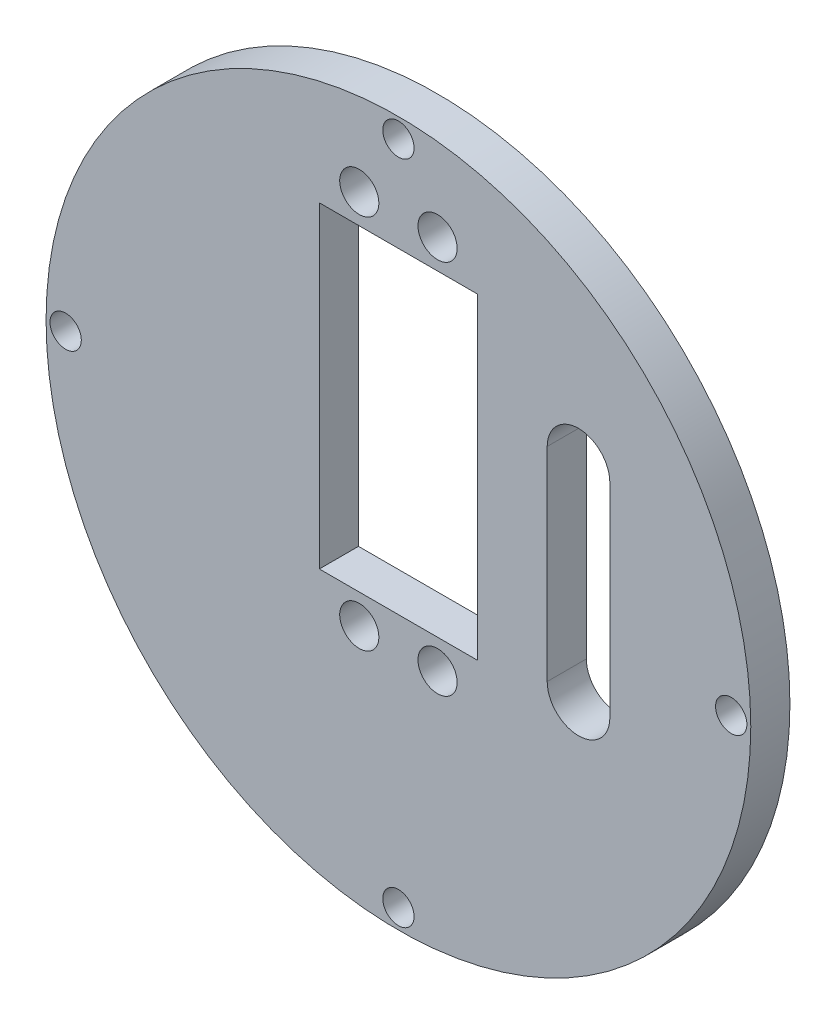
ISO-10303-21;
HEADER;
FILE_DESCRIPTION(('STEP AP214'),'2;1');
FILE_NAME('part.step','',(''),(''),'','','');
FILE_SCHEMA(('AUTOMOTIVE_DESIGN { 1 0 10303 214 1 1 1 1 }'));
ENDSEC;
DATA;
#1=APPLICATION_CONTEXT('core data for automotive mechanical design processes');
#2=APPLICATION_PROTOCOL_DEFINITION('international standard','automotive_design',2000,#1);
#3=PRODUCT_CONTEXT('',#1,'mechanical');
#4=PRODUCT('Part','Part','',(#3));
#5=PRODUCT_RELATED_PRODUCT_CATEGORY('part','',(#4));
#6=PRODUCT_DEFINITION_FORMATION('','',#4);
#7=PRODUCT_DEFINITION_CONTEXT('part definition',#1,'design');
#8=PRODUCT_DEFINITION('design','',#6,#7);
#9=PRODUCT_DEFINITION_SHAPE('','',#8);
#10=(LENGTH_UNIT() NAMED_UNIT(*) SI_UNIT(.MILLI.,.METRE.));
#11=(NAMED_UNIT(*) PLANE_ANGLE_UNIT() SI_UNIT($,.RADIAN.));
#12=(NAMED_UNIT(*) SI_UNIT($,.STERADIAN.) SOLID_ANGLE_UNIT());
#13=UNCERTAINTY_MEASURE_WITH_UNIT(LENGTH_MEASURE(1.E-05),#10,'distance_accuracy_value','');
#14=(GEOMETRIC_REPRESENTATION_CONTEXT(3) GLOBAL_UNCERTAINTY_ASSIGNED_CONTEXT((#13)) GLOBAL_UNIT_ASSIGNED_CONTEXT((#10,
#11,#12)) REPRESENTATION_CONTEXT('',''));
#15=CARTESIAN_POINT('',(0.,0.,0.));
#16=DIRECTION('',(0.,0.,1.));
#17=DIRECTION('',(1.,0.,0.));
#18=AXIS2_PLACEMENT_3D('',#15,#16,#17);
#19=CARTESIAN_POINT('',(0.,30.4,5.));
#20=DIRECTION('',(0.,1.,0.));
#21=DIRECTION('',(0.,0.,1.));
#22=AXIS2_PLACEMENT_3D('',#19,#20,#21);
#23=PLANE('',#22);
#24=DIRECTION('',(1.,0.,0.));
#25=VECTOR('',#24,1.);
#26=CARTESIAN_POINT('',(0.,30.4,0.));
#27=LINE('',#26,#25);
#28=CARTESIAN_POINT('',(-10.1,30.4,0.));
#29=VERTEX_POINT('',#28);
#30=CARTESIAN_POINT('',(10.1,30.4,0.));
#31=VERTEX_POINT('',#30);
#32=EDGE_CURVE('E203',#29,#31,#27,.T.);
#33=ORIENTED_EDGE('',*,*,#32,.T.);
#34=DIRECTION('',(0.,0.,-1.));
#35=VECTOR('',#34,1.);
#36=CARTESIAN_POINT('',(10.1,30.4,5.));
#37=LINE('',#36,#35);
#38=CARTESIAN_POINT('',(10.1,30.4,5.));
#39=VERTEX_POINT('',#38);
#40=EDGE_CURVE('E222',#39,#31,#37,.T.);
#41=ORIENTED_EDGE('',*,*,#40,.F.);
#42=DIRECTION('',(1.,0.,0.));
#43=VECTOR('',#42,1.);
#44=CARTESIAN_POINT('',(0.,30.4,5.));
#45=LINE('',#44,#43);
#46=CARTESIAN_POINT('',(-10.1,30.4,5.));
#47=VERTEX_POINT('',#46);
#48=EDGE_CURVE('E165',#47,#39,#45,.T.);
#49=ORIENTED_EDGE('',*,*,#48,.F.);
#50=DIRECTION('',(0.,0.,-1.));
#51=VECTOR('',#50,1.);
#52=CARTESIAN_POINT('',(-10.1,30.4,5.));
#53=LINE('',#52,#51);
#54=EDGE_CURVE('E179',#47,#29,#53,.T.);
#55=ORIENTED_EDGE('',*,*,#54,.T.);
#56=EDGE_LOOP('',(#33,#41,#49,#55));
#57=FACE_BOUND('',#56,.T.);
#58=ADVANCED_FACE('F46',(#57),#23,.F.);
#59=CARTESIAN_POINT('',(10.1,0.,5.));
#60=DIRECTION('',(1.,0.,0.));
#61=DIRECTION('',(0.,1.,0.));
#62=AXIS2_PLACEMENT_3D('',#59,#60,#61);
#63=PLANE('',#62);
#64=DIRECTION('',(0.,-1.,0.));
#65=VECTOR('',#64,1.);
#66=CARTESIAN_POINT('',(10.1,0.,0.));
#67=LINE('',#66,#65);
#68=CARTESIAN_POINT('',(10.1,-10.1,0.));
#69=VERTEX_POINT('',#68);
#70=EDGE_CURVE('E206',#31,#69,#67,.T.);
#71=ORIENTED_EDGE('',*,*,#70,.T.);
#72=DIRECTION('',(0.,0.,-1.));
#73=VECTOR('',#72,1.);
#74=CARTESIAN_POINT('',(10.1,-10.1,5.));
#75=LINE('',#74,#73);
#76=CARTESIAN_POINT('',(10.1,-10.1,5.));
#77=VERTEX_POINT('',#76);
#78=EDGE_CURVE('E220',#77,#69,#75,.T.);
#79=ORIENTED_EDGE('',*,*,#78,.F.);
#80=DIRECTION('',(0.,-1.,0.));
#81=VECTOR('',#80,1.);
#82=CARTESIAN_POINT('',(10.1,0.,5.));
#83=LINE('',#82,#81);
#84=EDGE_CURVE('E168',#39,#77,#83,.T.);
#85=ORIENTED_EDGE('',*,*,#84,.F.);
#86=ORIENTED_EDGE('',*,*,#40,.T.);
#87=EDGE_LOOP('',(#71,#79,#85,#86));
#88=FACE_BOUND('',#87,.T.);
#89=ADVANCED_FACE('F247',(#88),#63,.F.);
#90=CARTESIAN_POINT('',(0.,-10.1,5.));
#91=DIRECTION('',(0.,1.,0.));
#92=DIRECTION('',(0.,0.,1.));
#93=AXIS2_PLACEMENT_3D('',#90,#91,#92);
#94=PLANE('',#93);
#95=DIRECTION('',(1.,0.,0.));
#96=VECTOR('',#95,1.);
#97=CARTESIAN_POINT('',(0.,-10.1,0.));
#98=LINE('',#97,#96);
#99=CARTESIAN_POINT('',(-10.1,-10.1,0.));
#100=VERTEX_POINT('',#99);
#101=EDGE_CURVE('E209',#100,#69,#98,.T.);
#102=ORIENTED_EDGE('',*,*,#101,.F.);
#103=DIRECTION('',(0.,0.,-1.));
#104=VECTOR('',#103,1.);
#105=CARTESIAN_POINT('',(-10.1,-10.1,5.));
#106=LINE('',#105,#104);
#107=CARTESIAN_POINT('',(-10.1,-10.1,5.));
#108=VERTEX_POINT('',#107);
#109=EDGE_CURVE('E218',#108,#100,#106,.T.);
#110=ORIENTED_EDGE('',*,*,#109,.F.);
#111=DIRECTION('',(1.,0.,0.));
#112=VECTOR('',#111,1.);
#113=CARTESIAN_POINT('',(0.,-10.1,5.));
#114=LINE('',#113,#112);
#115=EDGE_CURVE('E170',#108,#77,#114,.T.);
#116=ORIENTED_EDGE('',*,*,#115,.T.);
#117=ORIENTED_EDGE('',*,*,#78,.T.);
#118=EDGE_LOOP('',(#102,#110,#116,#117));
#119=FACE_BOUND('',#118,.T.);
#120=ADVANCED_FACE('F253',(#119),#94,.T.);
#121=CARTESIAN_POINT('',(-10.1,0.,5.));
#122=DIRECTION('',(1.,0.,0.));
#123=DIRECTION('',(0.,1.,0.));
#124=AXIS2_PLACEMENT_3D('',#121,#122,#123);
#125=PLANE('',#124);
#126=DIRECTION('',(0.,-1.,0.));
#127=VECTOR('',#126,1.);
#128=CARTESIAN_POINT('',(-10.1,0.,0.));
#129=LINE('',#128,#127);
#130=EDGE_CURVE('E212',#29,#100,#129,.T.);
#131=ORIENTED_EDGE('',*,*,#130,.F.);
#132=ORIENTED_EDGE('',*,*,#54,.F.);
#133=DIRECTION('',(0.,-1.,0.));
#134=VECTOR('',#133,1.);
#135=CARTESIAN_POINT('',(-10.1,0.,5.));
#136=LINE('',#135,#134);
#137=EDGE_CURVE('E173',#47,#108,#136,.T.);
#138=ORIENTED_EDGE('',*,*,#137,.T.);
#139=ORIENTED_EDGE('',*,*,#109,.T.);
#140=EDGE_LOOP('',(#131,#132,#138,#139));
#141=FACE_BOUND('',#140,.T.);
#142=ADVANCED_FACE('F262',(#141),#125,.T.);
#143=CARTESIAN_POINT('',(-5.,34.15,5.));
#144=DIRECTION('',(0.,0.,-1.));
#145=DIRECTION('',(-1.,0.,0.));
#146=AXIS2_PLACEMENT_3D('',#143,#144,#145);
#147=CYLINDRICAL_SURFACE('',#146,2.5);
#148=CARTESIAN_POINT('',(-5.,34.15,5.));
#149=DIRECTION('',(0.,0.,1.));
#150=DIRECTION('',(1.,0.,0.));
#151=AXIS2_PLACEMENT_3D('',#148,#149,#150);
#152=CIRCLE('',#151,2.5);
#153=CARTESIAN_POINT('',(-2.5,34.15,5.));
#154=VERTEX_POINT('',#153);
#155=EDGE_CURVE('E162',#154,#154,#152,.T.);
#156=ORIENTED_EDGE('',*,*,#155,.T.);
#157=EDGE_LOOP('',(#156));
#158=FACE_BOUND('',#157,.T.);
#159=CARTESIAN_POINT('',(-5.,34.15,0.));
#160=DIRECTION('',(0.,0.,1.));
#161=DIRECTION('',(1.,0.,0.));
#162=AXIS2_PLACEMENT_3D('',#159,#160,#161);
#163=CIRCLE('',#162,2.5);
#164=CARTESIAN_POINT('',(-2.5,34.15,0.));
#165=VERTEX_POINT('',#164);
#166=EDGE_CURVE('E200',#165,#165,#163,.T.);
#167=ORIENTED_EDGE('',*,*,#166,.F.);
#168=EDGE_LOOP('',(#167));
#169=FACE_BOUND('',#168,.T.);
#170=ADVANCED_FACE('F258',(#158,#169),#147,.F.);
#171=CARTESIAN_POINT('',(5.,34.15,5.));
#172=DIRECTION('',(0.,0.,-1.));
#173=DIRECTION('',(-1.,0.,0.));
#174=AXIS2_PLACEMENT_3D('',#171,#172,#173);
#175=CYLINDRICAL_SURFACE('',#174,2.5);
#176=CARTESIAN_POINT('',(5.,34.15,5.));
#177=DIRECTION('',(0.,0.,1.));
#178=DIRECTION('',(1.,0.,0.));
#179=AXIS2_PLACEMENT_3D('',#176,#177,#178);
#180=CIRCLE('',#179,2.5);
#181=CARTESIAN_POINT('',(7.5,34.15,5.));
#182=VERTEX_POINT('',#181);
#183=EDGE_CURVE('E159',#182,#182,#180,.T.);
#184=ORIENTED_EDGE('',*,*,#183,.T.);
#185=EDGE_LOOP('',(#184));
#186=FACE_BOUND('',#185,.T.);
#187=CARTESIAN_POINT('',(5.,34.15,0.));
#188=DIRECTION('',(0.,0.,1.));
#189=DIRECTION('',(1.,0.,0.));
#190=AXIS2_PLACEMENT_3D('',#187,#188,#189);
#191=CIRCLE('',#190,2.5);
#192=CARTESIAN_POINT('',(7.5,34.15,0.));
#193=VERTEX_POINT('',#192);
#194=EDGE_CURVE('E197',#193,#193,#191,.T.);
#195=ORIENTED_EDGE('',*,*,#194,.F.);
#196=EDGE_LOOP('',(#195));
#197=FACE_BOUND('',#196,.T.);
#198=ADVANCED_FACE('F261',(#186,#197),#175,.F.);
#199=CARTESIAN_POINT('',(5.00000000000001,-13.85,5.));
#200=DIRECTION('',(0.,0.,-1.));
#201=DIRECTION('',(-1.,0.,0.));
#202=AXIS2_PLACEMENT_3D('',#199,#200,#201);
#203=CYLINDRICAL_SURFACE('',#202,2.5);
#204=CARTESIAN_POINT('',(5.00000000000001,-13.85,5.));
#205=DIRECTION('',(0.,0.,1.));
#206=DIRECTION('',(1.,0.,0.));
#207=AXIS2_PLACEMENT_3D('',#204,#205,#206);
#208=CIRCLE('',#207,2.5);
#209=CARTESIAN_POINT('',(7.50000000000001,-13.85,5.));
#210=VERTEX_POINT('',#209);
#211=EDGE_CURVE('E156',#210,#210,#208,.T.);
#212=ORIENTED_EDGE('',*,*,#211,.T.);
#213=EDGE_LOOP('',(#212));
#214=FACE_BOUND('',#213,.T.);
#215=CARTESIAN_POINT('',(5.00000000000001,-13.85,0.));
#216=DIRECTION('',(0.,0.,1.));
#217=DIRECTION('',(1.,0.,0.));
#218=AXIS2_PLACEMENT_3D('',#215,#216,#217);
#219=CIRCLE('',#218,2.5);
#220=CARTESIAN_POINT('',(7.50000000000001,-13.85,0.));
#221=VERTEX_POINT('',#220);
#222=EDGE_CURVE('E194',#221,#221,#219,.T.);
#223=ORIENTED_EDGE('',*,*,#222,.F.);
#224=EDGE_LOOP('',(#223));
#225=FACE_BOUND('',#224,.T.);
#226=ADVANCED_FACE('F266',(#214,#225),#203,.F.);
#227=CARTESIAN_POINT('',(-4.99999999999999,-13.85,5.));
#228=DIRECTION('',(0.,0.,-1.));
#229=DIRECTION('',(-1.,0.,0.));
#230=AXIS2_PLACEMENT_3D('',#227,#228,#229);
#231=CYLINDRICAL_SURFACE('',#230,2.5);
#232=CARTESIAN_POINT('',(-4.99999999999999,-13.85,5.));
#233=DIRECTION('',(0.,0.,1.));
#234=DIRECTION('',(1.,0.,0.));
#235=AXIS2_PLACEMENT_3D('',#232,#233,#234);
#236=CIRCLE('',#235,2.5);
#237=CARTESIAN_POINT('',(-2.49999999999999,-13.85,5.));
#238=VERTEX_POINT('',#237);
#239=EDGE_CURVE('E153',#238,#238,#236,.T.);
#240=ORIENTED_EDGE('',*,*,#239,.T.);
#241=EDGE_LOOP('',(#240));
#242=FACE_BOUND('',#241,.T.);
#243=CARTESIAN_POINT('',(-4.99999999999999,-13.85,0.));
#244=DIRECTION('',(0.,0.,1.));
#245=DIRECTION('',(1.,0.,0.));
#246=AXIS2_PLACEMENT_3D('',#243,#244,#245);
#247=CIRCLE('',#246,2.5);
#248=CARTESIAN_POINT('',(-2.49999999999999,-13.85,0.));
#249=VERTEX_POINT('',#248);
#250=EDGE_CURVE('E191',#249,#249,#247,.T.);
#251=ORIENTED_EDGE('',*,*,#250,.F.);
#252=EDGE_LOOP('',(#251));
#253=FACE_BOUND('',#252,.T.);
#254=ADVANCED_FACE('F270',(#242,#253),#231,.F.);
#255=CARTESIAN_POINT('',(42.5,0.,5.));
#256=DIRECTION('',(0.,0.,-1.));
#257=DIRECTION('',(-1.,0.,0.));
#258=AXIS2_PLACEMENT_3D('',#255,#256,#257);
#259=CYLINDRICAL_SURFACE('',#258,2.);
#260=CARTESIAN_POINT('',(42.5,0.,5.));
#261=DIRECTION('',(0.,0.,1.));
#262=DIRECTION('',(1.,0.,0.));
#263=AXIS2_PLACEMENT_3D('',#260,#261,#262);
#264=CIRCLE('',#263,2.);
#265=CARTESIAN_POINT('',(44.5,0.,5.));
#266=VERTEX_POINT('',#265);
#267=EDGE_CURVE('E150',#266,#266,#264,.T.);
#268=ORIENTED_EDGE('',*,*,#267,.T.);
#269=EDGE_LOOP('',(#268));
#270=FACE_BOUND('',#269,.T.);
#271=CARTESIAN_POINT('',(42.5,0.,0.));
#272=DIRECTION('',(0.,0.,1.));
#273=DIRECTION('',(1.,0.,0.));
#274=AXIS2_PLACEMENT_3D('',#271,#272,#273);
#275=CIRCLE('',#274,2.);
#276=CARTESIAN_POINT('',(44.5,0.,0.));
#277=VERTEX_POINT('',#276);
#278=EDGE_CURVE('E188',#277,#277,#275,.T.);
#279=ORIENTED_EDGE('',*,*,#278,.F.);
#280=EDGE_LOOP('',(#279));
#281=FACE_BOUND('',#280,.T.);
#282=ADVANCED_FACE('F274',(#270,#281),#259,.F.);
#283=CARTESIAN_POINT('',(0.,-42.5,5.));
#284=DIRECTION('',(0.,0.,-1.));
#285=DIRECTION('',(-1.,0.,0.));
#286=AXIS2_PLACEMENT_3D('',#283,#284,#285);
#287=CYLINDRICAL_SURFACE('',#286,2.);
#288=CARTESIAN_POINT('',(0.,-42.5,5.));
#289=DIRECTION('',(0.,0.,1.));
#290=DIRECTION('',(1.,0.,0.));
#291=AXIS2_PLACEMENT_3D('',#288,#289,#290);
#292=CIRCLE('',#291,2.);
#293=CARTESIAN_POINT('',(2.,-42.5,5.));
#294=VERTEX_POINT('',#293);
#295=EDGE_CURVE('E147',#294,#294,#292,.T.);
#296=ORIENTED_EDGE('',*,*,#295,.T.);
#297=EDGE_LOOP('',(#296));
#298=FACE_BOUND('',#297,.T.);
#299=CARTESIAN_POINT('',(0.,-42.5,0.));
#300=DIRECTION('',(0.,0.,1.));
#301=DIRECTION('',(1.,0.,0.));
#302=AXIS2_PLACEMENT_3D('',#299,#300,#301);
#303=CIRCLE('',#302,2.);
#304=CARTESIAN_POINT('',(2.,-42.5,0.));
#305=VERTEX_POINT('',#304);
#306=EDGE_CURVE('E185',#305,#305,#303,.T.);
#307=ORIENTED_EDGE('',*,*,#306,.F.);
#308=EDGE_LOOP('',(#307));
#309=FACE_BOUND('',#308,.T.);
#310=ADVANCED_FACE('F278',(#298,#309),#287,.F.);
#311=CARTESIAN_POINT('',(-42.5000000000001,0.,5.));
#312=DIRECTION('',(0.,0.,-1.));
#313=DIRECTION('',(-1.,0.,0.));
#314=AXIS2_PLACEMENT_3D('',#311,#312,#313);
#315=CYLINDRICAL_SURFACE('',#314,2.);
#316=CARTESIAN_POINT('',(-42.5000000000001,0.,5.));
#317=DIRECTION('',(0.,0.,1.));
#318=DIRECTION('',(1.,0.,0.));
#319=AXIS2_PLACEMENT_3D('',#316,#317,#318);
#320=CIRCLE('',#319,2.);
#321=CARTESIAN_POINT('',(-40.5000000000001,0.,5.));
#322=VERTEX_POINT('',#321);
#323=EDGE_CURVE('E143',#322,#322,#320,.T.);
#324=ORIENTED_EDGE('',*,*,#323,.T.);
#325=EDGE_LOOP('',(#324));
#326=FACE_BOUND('',#325,.T.);
#327=CARTESIAN_POINT('',(-42.5000000000001,0.,0.));
#328=DIRECTION('',(0.,0.,1.));
#329=DIRECTION('',(1.,0.,0.));
#330=AXIS2_PLACEMENT_3D('',#327,#328,#329);
#331=CIRCLE('',#330,2.);
#332=CARTESIAN_POINT('',(-40.5000000000001,0.,0.));
#333=VERTEX_POINT('',#332);
#334=EDGE_CURVE('E182',#333,#333,#331,.T.);
#335=ORIENTED_EDGE('',*,*,#334,.F.);
#336=EDGE_LOOP('',(#335));
#337=FACE_BOUND('',#336,.T.);
#338=ADVANCED_FACE('F281',(#326,#337),#315,.F.);
#339=CARTESIAN_POINT('',(0.,42.5,5.));
#340=DIRECTION('',(0.,0.,-1.));
#341=DIRECTION('',(-1.,0.,0.));
#342=AXIS2_PLACEMENT_3D('',#339,#340,#341);
#343=CYLINDRICAL_SURFACE('',#342,2.);
#344=CARTESIAN_POINT('',(0.,42.5,5.));
#345=DIRECTION('',(0.,0.,1.));
#346=DIRECTION('',(1.,0.,0.));
#347=AXIS2_PLACEMENT_3D('',#344,#345,#346);
#348=CIRCLE('',#347,2.);
#349=CARTESIAN_POINT('',(1.99999999999997,42.5,5.));
#350=VERTEX_POINT('',#349);
#351=EDGE_CURVE('E140',#350,#350,#348,.T.);
#352=ORIENTED_EDGE('',*,*,#351,.T.);
#353=EDGE_LOOP('',(#352));
#354=FACE_BOUND('',#353,.T.);
#355=CARTESIAN_POINT('',(0.,42.5,0.));
#356=DIRECTION('',(0.,0.,1.));
#357=DIRECTION('',(1.,0.,0.));
#358=AXIS2_PLACEMENT_3D('',#355,#356,#357);
#359=CIRCLE('',#358,2.);
#360=CARTESIAN_POINT('',(1.99999999999997,42.5,0.));
#361=VERTEX_POINT('',#360);
#362=EDGE_CURVE('E137',#361,#361,#359,.T.);
#363=ORIENTED_EDGE('',*,*,#362,.F.);
#364=EDGE_LOOP('',(#363));
#365=FACE_BOUND('',#364,.T.);
#366=ADVANCED_FACE('F48',(#354,#365),#343,.F.);
#367=CARTESIAN_POINT('',(0.,0.,5.));
#368=DIRECTION('',(0.,0.,-1.));
#369=DIRECTION('',(-1.,0.,0.));
#370=AXIS2_PLACEMENT_3D('',#367,#368,#369);
#371=CYLINDRICAL_SURFACE('',#370,45.);
#372=CARTESIAN_POINT('',(0.,0.,5.));
#373=DIRECTION('',(0.,0.,1.));
#374=DIRECTION('',(1.,0.,0.));
#375=AXIS2_PLACEMENT_3D('',#372,#373,#374);
#376=CIRCLE('',#375,45.);
#377=CARTESIAN_POINT('',(45.,0.,5.));
#378=VERTEX_POINT('',#377);
#379=EDGE_CURVE('E176',#378,#378,#376,.T.);
#380=ORIENTED_EDGE('',*,*,#379,.F.);
#381=EDGE_LOOP('',(#380));
#382=FACE_BOUND('',#381,.T.);
#383=CARTESIAN_POINT('',(0.,0.,0.));
#384=DIRECTION('',(0.,0.,1.));
#385=DIRECTION('',(1.,0.,0.));
#386=AXIS2_PLACEMENT_3D('',#383,#384,#385);
#387=CIRCLE('',#386,45.);
#388=CARTESIAN_POINT('',(45.,0.,0.));
#389=VERTEX_POINT('',#388);
#390=EDGE_CURVE('E144',#389,#389,#387,.T.);
#391=ORIENTED_EDGE('',*,*,#390,.T.);
#392=EDGE_LOOP('',(#391));
#393=FACE_BOUND('',#392,.T.);
#394=ADVANCED_FACE('F288',(#382,#393),#371,.T.);
#395=CARTESIAN_POINT('',(0.,0.,5.));
#396=DIRECTION('',(0.,0.,1.));
#397=DIRECTION('',(1.,0.,0.));
#398=AXIS2_PLACEMENT_3D('',#395,#396,#397);
#399=PLANE('',#398);
#400=CARTESIAN_POINT('',(23.,18.,5.));
#401=DIRECTION('',(0.,0.,1.));
#402=DIRECTION('',(1.,0.,0.));
#403=AXIS2_PLACEMENT_3D('',#400,#401,#402);
#404=CIRCLE('',#403,4.00000000000001);
#405=CARTESIAN_POINT('',(27.,18.,5.));
#406=VERTEX_POINT('',#405);
#407=CARTESIAN_POINT('',(19.,18.,5.));
#408=VERTEX_POINT('',#407);
#409=EDGE_CURVE('E61',#406,#408,#404,.T.);
#410=ORIENTED_EDGE('',*,*,#409,.F.);
#411=DIRECTION('',(0.,1.,0.));
#412=VECTOR('',#411,1.);
#413=CARTESIAN_POINT('',(27.,18.,5.));
#414=LINE('',#413,#412);
#415=CARTESIAN_POINT('',(27.,-8.,5.));
#416=VERTEX_POINT('',#415);
#417=EDGE_CURVE('E130',#416,#406,#414,.T.);
#418=ORIENTED_EDGE('',*,*,#417,.F.);
#419=CARTESIAN_POINT('',(23.,-8.,5.));
#420=DIRECTION('',(0.,0.,1.));
#421=DIRECTION('',(1.,0.,0.));
#422=AXIS2_PLACEMENT_3D('',#419,#420,#421);
#423=CIRCLE('',#422,4.00000000000001);
#424=CARTESIAN_POINT('',(19.,-8.,5.));
#425=VERTEX_POINT('',#424);
#426=EDGE_CURVE('E114',#425,#416,#423,.T.);
#427=ORIENTED_EDGE('',*,*,#426,.F.);
#428=DIRECTION('',(0.,-1.,0.));
#429=VECTOR('',#428,1.);
#430=CARTESIAN_POINT('',(19.,18.,5.));
#431=LINE('',#430,#429);
#432=EDGE_CURVE('E123',#408,#425,#431,.T.);
#433=ORIENTED_EDGE('',*,*,#432,.F.);
#434=EDGE_LOOP('',(#410,#418,#427,#433));
#435=FACE_BOUND('',#434,.T.);
#436=ORIENTED_EDGE('',*,*,#351,.F.);
#437=EDGE_LOOP('',(#436));
#438=FACE_BOUND('',#437,.T.);
#439=ORIENTED_EDGE('',*,*,#323,.F.);
#440=EDGE_LOOP('',(#439));
#441=FACE_BOUND('',#440,.T.);
#442=ORIENTED_EDGE('',*,*,#295,.F.);
#443=EDGE_LOOP('',(#442));
#444=FACE_BOUND('',#443,.T.);
#445=ORIENTED_EDGE('',*,*,#267,.F.);
#446=EDGE_LOOP('',(#445));
#447=FACE_BOUND('',#446,.T.);
#448=ORIENTED_EDGE('',*,*,#239,.F.);
#449=EDGE_LOOP('',(#448));
#450=FACE_BOUND('',#449,.T.);
#451=ORIENTED_EDGE('',*,*,#211,.F.);
#452=EDGE_LOOP('',(#451));
#453=FACE_BOUND('',#452,.T.);
#454=ORIENTED_EDGE('',*,*,#183,.F.);
#455=EDGE_LOOP('',(#454));
#456=FACE_BOUND('',#455,.T.);
#457=ORIENTED_EDGE('',*,*,#155,.F.);
#458=EDGE_LOOP('',(#457));
#459=FACE_BOUND('',#458,.T.);
#460=ORIENTED_EDGE('',*,*,#48,.T.);
#461=ORIENTED_EDGE('',*,*,#84,.T.);
#462=ORIENTED_EDGE('',*,*,#115,.F.);
#463=ORIENTED_EDGE('',*,*,#137,.F.);
#464=EDGE_LOOP('',(#460,#461,#462,#463));
#465=FACE_BOUND('',#464,.T.);
#466=ORIENTED_EDGE('',*,*,#379,.T.);
#467=EDGE_LOOP('',(#466));
#468=FACE_BOUND('',#467,.T.);
#469=ADVANCED_FACE('F127',(#435,#438,#441,#444,#447,#450,#453,#456,#459,#465,#468),#399,.T.);
#470=CARTESIAN_POINT('',(0.,0.,0.));
#471=DIRECTION('',(0.,0.,1.));
#472=DIRECTION('',(1.,0.,0.));
#473=AXIS2_PLACEMENT_3D('',#470,#471,#472);
#474=PLANE('',#473);
#475=DIRECTION('',(0.,1.,0.));
#476=VECTOR('',#475,1.);
#477=CARTESIAN_POINT('',(27.,0.,0.));
#478=LINE('',#477,#476);
#479=CARTESIAN_POINT('',(27.,-8.,0.));
#480=VERTEX_POINT('',#479);
#481=CARTESIAN_POINT('',(27.,18.,0.));
#482=VERTEX_POINT('',#481);
#483=EDGE_CURVE('E54',#480,#482,#478,.T.);
#484=ORIENTED_EDGE('',*,*,#483,.T.);
#485=CARTESIAN_POINT('',(23.,18.,0.));
#486=DIRECTION('',(0.,0.,1.));
#487=DIRECTION('',(1.,0.,0.));
#488=AXIS2_PLACEMENT_3D('',#485,#486,#487);
#489=CIRCLE('',#488,4.00000000000001);
#490=CARTESIAN_POINT('',(19.,18.,0.));
#491=VERTEX_POINT('',#490);
#492=EDGE_CURVE('E13',#482,#491,#489,.T.);
#493=ORIENTED_EDGE('',*,*,#492,.T.);
#494=DIRECTION('',(0.,-1.,0.));
#495=VECTOR('',#494,1.);
#496=CARTESIAN_POINT('',(19.,0.,0.));
#497=LINE('',#496,#495);
#498=CARTESIAN_POINT('',(19.,-8.,0.));
#499=VERTEX_POINT('',#498);
#500=EDGE_CURVE('E225',#491,#499,#497,.T.);
#501=ORIENTED_EDGE('',*,*,#500,.T.);
#502=CARTESIAN_POINT('',(23.,-8.,0.));
#503=DIRECTION('',(0.,0.,1.));
#504=DIRECTION('',(1.,0.,0.));
#505=AXIS2_PLACEMENT_3D('',#502,#503,#504);
#506=CIRCLE('',#505,4.00000000000001);
#507=EDGE_CURVE('E117',#499,#480,#506,.T.);
#508=ORIENTED_EDGE('',*,*,#507,.T.);
#509=EDGE_LOOP('',(#484,#493,#501,#508));
#510=FACE_BOUND('',#509,.T.);
#511=ORIENTED_EDGE('',*,*,#362,.T.);
#512=EDGE_LOOP('',(#511));
#513=FACE_BOUND('',#512,.T.);
#514=ORIENTED_EDGE('',*,*,#334,.T.);
#515=EDGE_LOOP('',(#514));
#516=FACE_BOUND('',#515,.T.);
#517=ORIENTED_EDGE('',*,*,#306,.T.);
#518=EDGE_LOOP('',(#517));
#519=FACE_BOUND('',#518,.T.);
#520=ORIENTED_EDGE('',*,*,#278,.T.);
#521=EDGE_LOOP('',(#520));
#522=FACE_BOUND('',#521,.T.);
#523=ORIENTED_EDGE('',*,*,#250,.T.);
#524=EDGE_LOOP('',(#523));
#525=FACE_BOUND('',#524,.T.);
#526=ORIENTED_EDGE('',*,*,#222,.T.);
#527=EDGE_LOOP('',(#526));
#528=FACE_BOUND('',#527,.T.);
#529=ORIENTED_EDGE('',*,*,#194,.T.);
#530=EDGE_LOOP('',(#529));
#531=FACE_BOUND('',#530,.T.);
#532=ORIENTED_EDGE('',*,*,#166,.T.);
#533=EDGE_LOOP('',(#532));
#534=FACE_BOUND('',#533,.T.);
#535=ORIENTED_EDGE('',*,*,#32,.F.);
#536=ORIENTED_EDGE('',*,*,#130,.T.);
#537=ORIENTED_EDGE('',*,*,#101,.T.);
#538=ORIENTED_EDGE('',*,*,#70,.F.);
#539=EDGE_LOOP('',(#535,#536,#537,#538));
#540=FACE_BOUND('',#539,.T.);
#541=ORIENTED_EDGE('',*,*,#390,.F.);
#542=EDGE_LOOP('',(#541));
#543=FACE_BOUND('',#542,.T.);
#544=ADVANCED_FACE('F229',(#510,#513,#516,#519,#522,#525,#528,#531,#534,#540,#543),#474,.F.);
#545=CARTESIAN_POINT('',(23.,18.,-5.));
#546=DIRECTION('',(0.,0.,1.));
#547=DIRECTION('',(1.,0.,0.));
#548=AXIS2_PLACEMENT_3D('',#545,#546,#547);
#549=CYLINDRICAL_SURFACE('',#548,4.00000000000001);
#550=DIRECTION('',(0.,0.,1.));
#551=VECTOR('',#550,1.);
#552=CARTESIAN_POINT('',(27.,18.,-5.));
#553=LINE('',#552,#551);
#554=EDGE_CURVE('E135',#482,#406,#553,.T.);
#555=ORIENTED_EDGE('',*,*,#554,.T.);
#556=ORIENTED_EDGE('',*,*,#409,.T.);
#557=DIRECTION('',(0.,0.,1.));
#558=VECTOR('',#557,1.);
#559=CARTESIAN_POINT('',(19.,18.,-5.));
#560=LINE('',#559,#558);
#561=EDGE_CURVE('E120',#491,#408,#560,.T.);
#562=ORIENTED_EDGE('',*,*,#561,.F.);
#563=ORIENTED_EDGE('',*,*,#492,.F.);
#564=EDGE_LOOP('',(#555,#556,#562,#563));
#565=FACE_BOUND('',#564,.T.);
#566=ADVANCED_FACE('F234',(#565),#549,.F.);
#567=CARTESIAN_POINT('',(27.,18.,-5.));
#568=DIRECTION('',(1.,0.,0.));
#569=DIRECTION('',(0.,0.,-1.));
#570=AXIS2_PLACEMENT_3D('',#567,#568,#569);
#571=PLANE('',#570);
#572=DIRECTION('',(0.,0.,1.));
#573=VECTOR('',#572,1.);
#574=CARTESIAN_POINT('',(27.,-8.,-5.));
#575=LINE('',#574,#573);
#576=EDGE_CURVE('E119',#480,#416,#575,.T.);
#577=ORIENTED_EDGE('',*,*,#576,.T.);
#578=ORIENTED_EDGE('',*,*,#417,.T.);
#579=ORIENTED_EDGE('',*,*,#554,.F.);
#580=ORIENTED_EDGE('',*,*,#483,.F.);
#581=EDGE_LOOP('',(#577,#578,#579,#580));
#582=FACE_BOUND('',#581,.T.);
#583=ADVANCED_FACE('F233',(#582),#571,.F.);
#584=CARTESIAN_POINT('',(23.,-8.,-5.));
#585=DIRECTION('',(0.,0.,1.));
#586=DIRECTION('',(1.,0.,0.));
#587=AXIS2_PLACEMENT_3D('',#584,#585,#586);
#588=CYLINDRICAL_SURFACE('',#587,4.00000000000001);
#589=DIRECTION('',(0.,0.,1.));
#590=VECTOR('',#589,1.);
#591=CARTESIAN_POINT('',(19.,-8.,-5.));
#592=LINE('',#591,#590);
#593=EDGE_CURVE('E69',#499,#425,#592,.T.);
#594=ORIENTED_EDGE('',*,*,#593,.T.);
#595=ORIENTED_EDGE('',*,*,#426,.T.);
#596=ORIENTED_EDGE('',*,*,#576,.F.);
#597=ORIENTED_EDGE('',*,*,#507,.F.);
#598=EDGE_LOOP('',(#594,#595,#596,#597));
#599=FACE_BOUND('',#598,.T.);
#600=ADVANCED_FACE('F111',(#599),#588,.F.);
#601=CARTESIAN_POINT('',(19.,18.,-5.));
#602=DIRECTION('',(-1.,0.,0.));
#603=DIRECTION('',(0.,0.,1.));
#604=AXIS2_PLACEMENT_3D('',#601,#602,#603);
#605=PLANE('',#604);
#606=ORIENTED_EDGE('',*,*,#561,.T.);
#607=ORIENTED_EDGE('',*,*,#432,.T.);
#608=ORIENTED_EDGE('',*,*,#593,.F.);
#609=ORIENTED_EDGE('',*,*,#500,.F.);
#610=EDGE_LOOP('',(#606,#607,#608,#609));
#611=FACE_BOUND('',#610,.T.);
#612=ADVANCED_FACE('F124',(#611),#605,.F.);
#613=CLOSED_SHELL('',(#58,#89,#120,#142,#170,#198,#226,#254,#282,#310,#338,#366,#394,#469,#544,
#566,#583,#600,#612));
#614=MANIFOLD_SOLID_BREP('B2',#613);
#615=ADVANCED_BREP_SHAPE_REPRESENTATION('',(#18,#614),#14);
#616=SHAPE_DEFINITION_REPRESENTATION(#9,#615);
ENDSEC;
END-ISO-10303-21;
